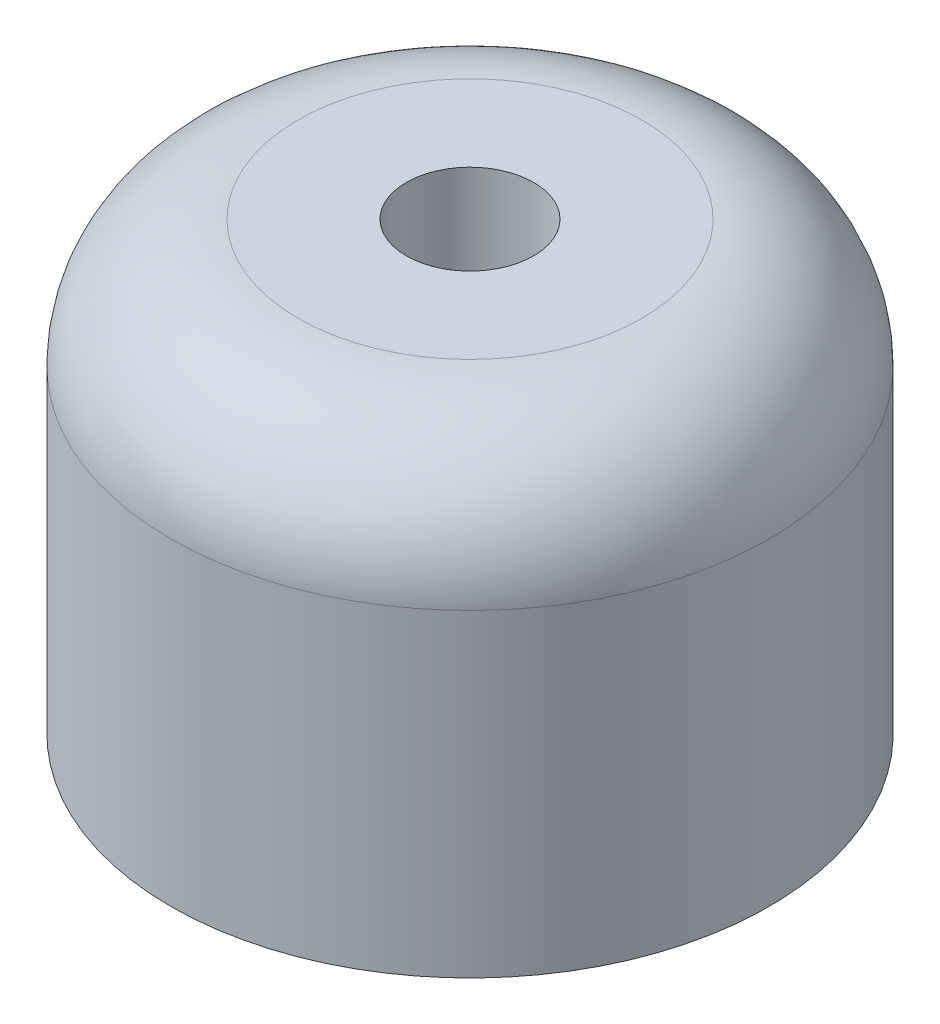
ISO-10303-21;
HEADER;
FILE_DESCRIPTION(('STEP AP214'),'2;1');
FILE_NAME('part.step','',(''),(''),'','','');
FILE_SCHEMA(('AUTOMOTIVE_DESIGN { 1 0 10303 214 1 1 1 1 }'));
ENDSEC;
DATA;
#1=APPLICATION_CONTEXT('core data for automotive mechanical design processes');
#2=APPLICATION_PROTOCOL_DEFINITION('international standard','automotive_design',2000,#1);
#3=PRODUCT_CONTEXT('',#1,'mechanical');
#4=PRODUCT('Part','Part','',(#3));
#5=PRODUCT_RELATED_PRODUCT_CATEGORY('part','',(#4));
#6=PRODUCT_DEFINITION_FORMATION('','',#4);
#7=PRODUCT_DEFINITION_CONTEXT('part definition',#1,'design');
#8=PRODUCT_DEFINITION('design','',#6,#7);
#9=PRODUCT_DEFINITION_SHAPE('','',#8);
#10=(LENGTH_UNIT() NAMED_UNIT(*) SI_UNIT(.MILLI.,.METRE.));
#11=(NAMED_UNIT(*) PLANE_ANGLE_UNIT() SI_UNIT($,.RADIAN.));
#12=(NAMED_UNIT(*) SI_UNIT($,.STERADIAN.) SOLID_ANGLE_UNIT());
#13=UNCERTAINTY_MEASURE_WITH_UNIT(LENGTH_MEASURE(1.E-05),#10,'distance_accuracy_value','');
#14=(GEOMETRIC_REPRESENTATION_CONTEXT(3) GLOBAL_UNCERTAINTY_ASSIGNED_CONTEXT((#13)) GLOBAL_UNIT_ASSIGNED_CONTEXT((#10,
#11,#12)) REPRESENTATION_CONTEXT('',''));
#15=CARTESIAN_POINT('',(0.,0.,0.));
#16=DIRECTION('',(0.,0.,1.));
#17=DIRECTION('',(1.,0.,0.));
#18=AXIS2_PLACEMENT_3D('',#15,#16,#17);
#19=CARTESIAN_POINT('',(0.,350.,0.));
#20=DIRECTION('',(0.,-1.,0.));
#21=DIRECTION('',(0.,0.,-1.));
#22=AXIS2_PLACEMENT_3D('',#19,#20,#21);
#23=CYLINDRICAL_SURFACE('',#22,235.);
#24=CARTESIAN_POINT('',(0.,250.,0.));
#25=DIRECTION('',(0.,1.,0.));
#26=DIRECTION('',(0.,0.,1.));
#27=AXIS2_PLACEMENT_3D('',#24,#25,#26);
#28=CIRCLE('',#27,235.);
#29=CARTESIAN_POINT('',(0.,250.,235.));
#30=VERTEX_POINT('',#29);
#31=EDGE_CURVE('E10',#30,#30,#28,.F.);
#32=ORIENTED_EDGE('',*,*,#31,.T.);
#33=EDGE_LOOP('',(#32));
#34=FACE_BOUND('',#33,.T.);
#35=CARTESIAN_POINT('',(0.,0.,0.));
#36=DIRECTION('',(0.,1.,0.));
#37=DIRECTION('',(0.,0.,1.));
#38=AXIS2_PLACEMENT_3D('',#35,#36,#37);
#39=CIRCLE('',#38,235.);
#40=CARTESIAN_POINT('',(0.,0.,235.));
#41=VERTEX_POINT('',#40);
#42=EDGE_CURVE('E50',#41,#41,#39,.T.);
#43=ORIENTED_EDGE('',*,*,#42,.T.);
#44=EDGE_LOOP('',(#43));
#45=FACE_BOUND('',#44,.T.);
#46=ADVANCED_FACE('F37',(#34,#45),#23,.T.);
#47=CARTESIAN_POINT('',(0.,350.,0.));
#48=DIRECTION('',(0.,1.,0.));
#49=DIRECTION('',(0.,0.,1.));
#50=AXIS2_PLACEMENT_3D('',#47,#48,#49);
#51=PLANE('',#50);
#52=CARTESIAN_POINT('',(0.,350.,0.));
#53=DIRECTION('',(0.,1.,0.));
#54=DIRECTION('',(0.,0.,1.));
#55=AXIS2_PLACEMENT_3D('',#52,#53,#54);
#56=CIRCLE('',#55,135.);
#57=CARTESIAN_POINT('',(0.,350.,135.));
#58=VERTEX_POINT('',#57);
#59=EDGE_CURVE('E45',#58,#58,#56,.T.);
#60=ORIENTED_EDGE('',*,*,#59,.T.);
#61=EDGE_LOOP('',(#60));
#62=FACE_BOUND('',#61,.T.);
#63=CARTESIAN_POINT('',(0.,350.,0.));
#64=DIRECTION('',(0.,1.,0.));
#65=DIRECTION('',(0.,0.,1.));
#66=AXIS2_PLACEMENT_3D('',#63,#64,#65);
#67=CIRCLE('',#66,50.);
#68=CARTESIAN_POINT('',(0.,350.,50.));
#69=VERTEX_POINT('',#68);
#70=EDGE_CURVE('E58',#69,#69,#67,.T.);
#71=ORIENTED_EDGE('',*,*,#70,.F.);
#72=EDGE_LOOP('',(#71));
#73=FACE_BOUND('',#72,.T.);
#74=ADVANCED_FACE('F75',(#62,#73),#51,.T.);
#75=CARTESIAN_POINT('',(0.,0.,0.));
#76=DIRECTION('',(0.,1.,0.));
#77=DIRECTION('',(0.,0.,1.));
#78=AXIS2_PLACEMENT_3D('',#75,#76,#77);
#79=PLANE('',#78);
#80=ORIENTED_EDGE('',*,*,#42,.F.);
#81=EDGE_LOOP('',(#80));
#82=FACE_BOUND('',#81,.T.);
#83=ADVANCED_FACE('F71',(#82),#79,.F.);
#84=CARTESIAN_POINT('',(0.,100.,0.));
#85=DIRECTION('',(0.,1.,0.));
#86=DIRECTION('',(0.,0.,1.));
#87=AXIS2_PLACEMENT_3D('',#84,#85,#86);
#88=CYLINDRICAL_SURFACE('',#87,50.);
#89=CARTESIAN_POINT('',(0.,100.,0.));
#90=DIRECTION('',(0.,1.,0.));
#91=DIRECTION('',(0.,0.,1.));
#92=AXIS2_PLACEMENT_3D('',#89,#90,#91);
#93=CIRCLE('',#92,50.);
#94=CARTESIAN_POINT('',(0.,100.,50.));
#95=VERTEX_POINT('',#94);
#96=EDGE_CURVE('E55',#95,#95,#93,.T.);
#97=ORIENTED_EDGE('',*,*,#96,.F.);
#98=EDGE_LOOP('',(#97));
#99=FACE_BOUND('',#98,.T.);
#100=ORIENTED_EDGE('',*,*,#70,.T.);
#101=EDGE_LOOP('',(#100));
#102=FACE_BOUND('',#101,.T.);
#103=ADVANCED_FACE('F68',(#99,#102),#88,.F.);
#104=CARTESIAN_POINT('',(0.,100.,0.));
#105=DIRECTION('',(0.,1.,0.));
#106=DIRECTION('',(0.,0.,1.));
#107=AXIS2_PLACEMENT_3D('',#104,#105,#106);
#108=PLANE('',#107);
#109=ORIENTED_EDGE('',*,*,#96,.T.);
#110=EDGE_LOOP('',(#109));
#111=FACE_BOUND('',#110,.T.);
#112=ADVANCED_FACE('F66',(#111),#108,.T.);
#113=CARTESIAN_POINT('',(0.,250.,0.));
#114=DIRECTION('',(0.,1.,0.));
#115=DIRECTION('',(0.,0.,1.));
#116=AXIS2_PLACEMENT_3D('',#113,#114,#115);
#117=TOROIDAL_SURFACE('',#116,135.,100.);
#118=ORIENTED_EDGE('',*,*,#31,.F.);
#119=EDGE_LOOP('',(#118));
#120=FACE_BOUND('',#119,.T.);
#121=ORIENTED_EDGE('',*,*,#59,.F.);
#122=EDGE_LOOP('',(#121));
#123=FACE_BOUND('',#122,.T.);
#124=ADVANCED_FACE('F39',(#120,#123),#117,.T.);
#125=CLOSED_SHELL('',(#46,#74,#83,#103,#112,#124));
#126=MANIFOLD_SOLID_BREP('B2',#125);
#127=ADVANCED_BREP_SHAPE_REPRESENTATION('',(#18,#126),#14);
#128=SHAPE_DEFINITION_REPRESENTATION(#9,#127);
ENDSEC;
END-ISO-10303-21;
